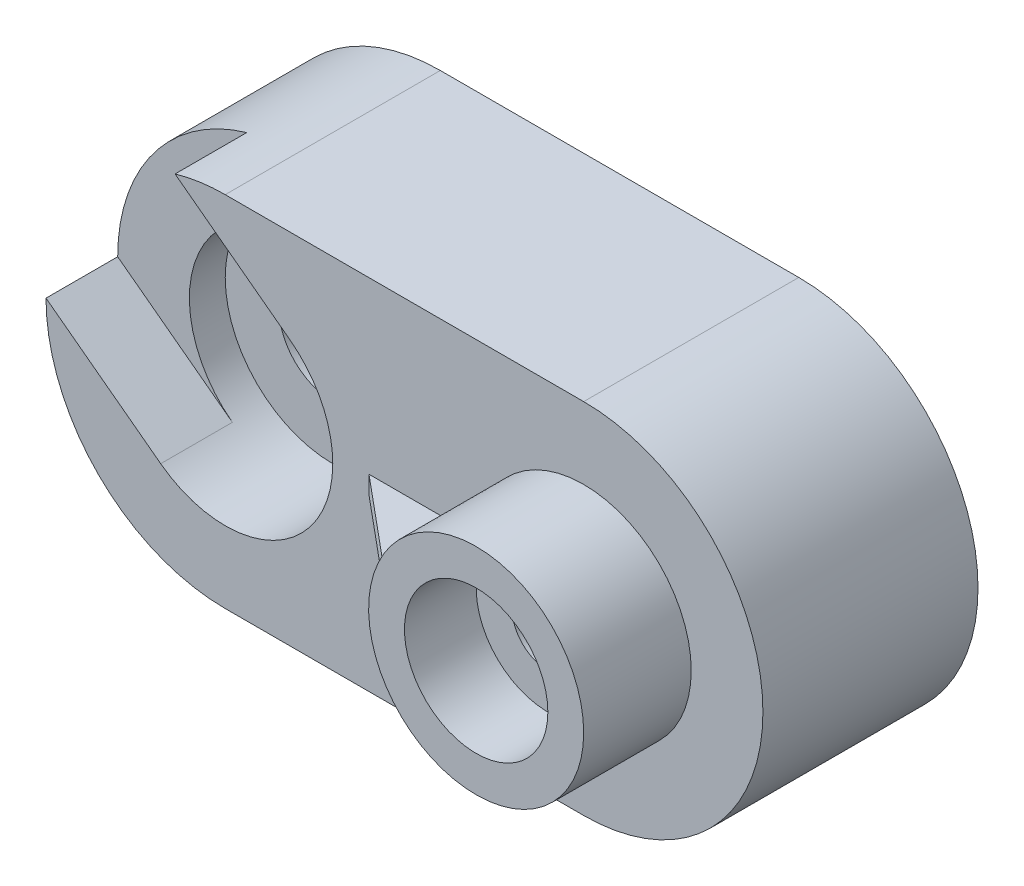
ISO-10303-21;
HEADER;
FILE_DESCRIPTION(('STEP AP214'),'2;1');
FILE_NAME('part.step','',(''),(''),'','','');
FILE_SCHEMA(('AUTOMOTIVE_DESIGN { 1 0 10303 214 1 1 1 1 }'));
ENDSEC;
DATA;
#1=APPLICATION_CONTEXT('core data for automotive mechanical design processes');
#2=APPLICATION_PROTOCOL_DEFINITION('international standard','automotive_design',2000,#1);
#3=PRODUCT_CONTEXT('',#1,'mechanical');
#4=PRODUCT('Part','Part','',(#3));
#5=PRODUCT_RELATED_PRODUCT_CATEGORY('part','',(#4));
#6=PRODUCT_DEFINITION_FORMATION('','',#4);
#7=PRODUCT_DEFINITION_CONTEXT('part definition',#1,'design');
#8=PRODUCT_DEFINITION('design','',#6,#7);
#9=PRODUCT_DEFINITION_SHAPE('','',#8);
#10=(LENGTH_UNIT() NAMED_UNIT(*) SI_UNIT(.MILLI.,.METRE.));
#11=(NAMED_UNIT(*) PLANE_ANGLE_UNIT() SI_UNIT($,.RADIAN.));
#12=(NAMED_UNIT(*) SI_UNIT($,.STERADIAN.) SOLID_ANGLE_UNIT());
#13=UNCERTAINTY_MEASURE_WITH_UNIT(LENGTH_MEASURE(1.E-05),#10,'distance_accuracy_value','');
#14=(GEOMETRIC_REPRESENTATION_CONTEXT(3) GLOBAL_UNCERTAINTY_ASSIGNED_CONTEXT((#13)) GLOBAL_UNIT_ASSIGNED_CONTEXT((#10,
#11,#12)) REPRESENTATION_CONTEXT('',''));
#15=CARTESIAN_POINT('',(0.,0.,0.));
#16=DIRECTION('',(0.,0.,1.));
#17=DIRECTION('',(1.,0.,0.));
#18=AXIS2_PLACEMENT_3D('',#15,#16,#17);
#19=CARTESIAN_POINT('',(0.,0.,60.));
#20=DIRECTION('',(0.,0.,1.));
#21=DIRECTION('',(1.,0.,0.));
#22=AXIS2_PLACEMENT_3D('',#19,#20,#21);
#23=PLANE('',#22);
#24=DIRECTION('',(0.,-1.,0.));
#25=VECTOR('',#24,1.);
#26=CARTESIAN_POINT('',(40.1043481422465,2.5,60.));
#27=LINE('',#26,#25);
#28=CARTESIAN_POINT('',(40.1043481422465,2.5,60.));
#29=VERTEX_POINT('',#28);
#30=CARTESIAN_POINT('',(40.1043481422465,-2.5,60.));
#31=VERTEX_POINT('',#30);
#32=EDGE_CURVE('E56',#29,#31,#27,.T.);
#33=ORIENTED_EDGE('',*,*,#32,.F.);
#34=DIRECTION('',(-1.,0.,0.));
#35=VECTOR('',#34,1.);
#36=CARTESIAN_POINT('',(70.1043481422465,2.5,60.));
#37=LINE('',#36,#35);
#38=CARTESIAN_POINT('',(70.1043481422465,2.5,60.));
#39=VERTEX_POINT('',#38);
#40=EDGE_CURVE('E278',#39,#29,#37,.T.);
#41=ORIENTED_EDGE('',*,*,#40,.F.);
#42=CARTESIAN_POINT('',(100.,0.,60.));
#43=DIRECTION('',(0.,0.,1.));
#44=DIRECTION('',(1.,0.,0.));
#45=AXIS2_PLACEMENT_3D('',#42,#43,#44);
#46=CIRCLE('',#45,30.);
#47=CARTESIAN_POINT('',(70.1043481422465,-2.5,60.));
#48=VERTEX_POINT('',#47);
#49=EDGE_CURVE('E178',#48,#39,#46,.T.);
#50=ORIENTED_EDGE('',*,*,#49,.F.);
#51=DIRECTION('',(1.,0.,0.));
#52=VECTOR('',#51,1.);
#53=CARTESIAN_POINT('',(70.1043481422465,-2.5,60.));
#54=LINE('',#53,#52);
#55=EDGE_CURVE('E162',#31,#48,#54,.T.);
#56=ORIENTED_EDGE('',*,*,#55,.F.);
#57=EDGE_LOOP('',(#33,#41,#50,#56));
#58=FACE_BOUND('',#57,.T.);
#59=CARTESIAN_POINT('',(0.,0.,60.));
#60=DIRECTION('',(0.,0.,1.));
#61=DIRECTION('',(1.,0.,0.));
#62=AXIS2_PLACEMENT_3D('',#59,#60,#61);
#63=CIRCLE('',#62,30.);
#64=CARTESIAN_POINT('',(-18.,-24.,60.));
#65=VERTEX_POINT('',#64);
#66=CARTESIAN_POINT('',(18.,24.,60.));
#67=VERTEX_POINT('',#66);
#68=EDGE_CURVE('E300',#65,#67,#63,.T.);
#69=ORIENTED_EDGE('',*,*,#68,.F.);
#70=DIRECTION('',(-0.8,0.6,0.));
#71=VECTOR('',#70,1.);
#72=CARTESIAN_POINT('',(-18.,-24.,60.));
#73=LINE('',#72,#71);
#74=CARTESIAN_POINT('',(-50.,0.,60.));
#75=VERTEX_POINT('',#74);
#76=EDGE_CURVE('E272',#65,#75,#73,.T.);
#77=ORIENTED_EDGE('',*,*,#76,.T.);
#78=CARTESIAN_POINT('',(0.,0.,60.));
#79=DIRECTION('',(0.,0.,1.));
#80=DIRECTION('',(1.,0.,0.));
#81=AXIS2_PLACEMENT_3D('',#78,#79,#80);
#82=CIRCLE('',#81,50.);
#83=CARTESIAN_POINT('',(0.,-50.,60.));
#84=VERTEX_POINT('',#83);
#85=EDGE_CURVE('E222',#75,#84,#82,.T.);
#86=ORIENTED_EDGE('',*,*,#85,.T.);
#87=DIRECTION('',(1.,0.,0.));
#88=VECTOR('',#87,1.);
#89=CARTESIAN_POINT('',(0.,-50.,60.));
#90=LINE('',#89,#88);
#91=CARTESIAN_POINT('',(100.,-50.,60.));
#92=VERTEX_POINT('',#91);
#93=EDGE_CURVE('E221',#84,#92,#90,.T.);
#94=ORIENTED_EDGE('',*,*,#93,.T.);
#95=CARTESIAN_POINT('',(100.,0.,60.));
#96=DIRECTION('',(0.,0.,1.));
#97=DIRECTION('',(1.,0.,0.));
#98=AXIS2_PLACEMENT_3D('',#95,#96,#97);
#99=CIRCLE('',#98,50.);
#100=CARTESIAN_POINT('',(100.,50.,60.));
#101=VERTEX_POINT('',#100);
#102=EDGE_CURVE('E224',#92,#101,#99,.T.);
#103=ORIENTED_EDGE('',*,*,#102,.T.);
#104=DIRECTION('',(-1.,0.,0.));
#105=VECTOR('',#104,1.);
#106=CARTESIAN_POINT('',(0.,50.,60.));
#107=LINE('',#106,#105);
#108=CARTESIAN_POINT('',(0.,50.,60.));
#109=VERTEX_POINT('',#108);
#110=EDGE_CURVE('E226',#101,#109,#107,.T.);
#111=ORIENTED_EDGE('',*,*,#110,.T.);
#112=CARTESIAN_POINT('',(-14.,48.,60.));
#113=VERTEX_POINT('',#112);
#114=EDGE_CURVE('E218',#109,#113,#82,.T.);
#115=ORIENTED_EDGE('',*,*,#114,.T.);
#116=DIRECTION('',(-0.8,0.6,0.));
#117=VECTOR('',#116,1.);
#118=CARTESIAN_POINT('',(18.,24.,60.));
#119=LINE('',#118,#117);
#120=EDGE_CURVE('E286',#67,#113,#119,.T.);
#121=ORIENTED_EDGE('',*,*,#120,.F.);
#122=EDGE_LOOP('',(#69,#77,#86,#94,#103,#111,#115,#121));
#123=FACE_BOUND('',#122,.T.);
#124=ADVANCED_FACE('F33',(#58,#123),#23,.T.);
#125=CARTESIAN_POINT('',(0.,0.,60.));
#126=DIRECTION('',(0.,0.,-1.));
#127=DIRECTION('',(-1.,0.,0.));
#128=AXIS2_PLACEMENT_3D('',#125,#126,#127);
#129=CYLINDRICAL_SURFACE('',#128,50.);
#130=DIRECTION('',(0.,0.,1.));
#131=VECTOR('',#130,1.);
#132=CARTESIAN_POINT('',(-50.,0.,40.));
#133=LINE('',#132,#131);
#134=CARTESIAN_POINT('',(-50.,0.,40.));
#135=VERTEX_POINT('',#134);
#136=EDGE_CURVE('E274',#135,#75,#133,.T.);
#137=ORIENTED_EDGE('',*,*,#136,.F.);
#138=CARTESIAN_POINT('',(0.,0.,40.));
#139=DIRECTION('',(0.,0.,1.));
#140=DIRECTION('',(1.,0.,0.));
#141=AXIS2_PLACEMENT_3D('',#138,#139,#140);
#142=CIRCLE('',#141,50.);
#143=CARTESIAN_POINT('',(-14.,48.,40.));
#144=VERTEX_POINT('',#143);
#145=EDGE_CURVE('E276',#144,#135,#142,.T.);
#146=ORIENTED_EDGE('',*,*,#145,.F.);
#147=DIRECTION('',(0.,0.,1.));
#148=VECTOR('',#147,1.);
#149=CARTESIAN_POINT('',(-14.,48.,40.));
#150=LINE('',#149,#148);
#151=EDGE_CURVE('E279',#144,#113,#150,.T.);
#152=ORIENTED_EDGE('',*,*,#151,.T.);
#153=ORIENTED_EDGE('',*,*,#114,.F.);
#154=DIRECTION('',(0.,0.,-1.));
#155=VECTOR('',#154,1.);
#156=CARTESIAN_POINT('',(0.,50.,60.));
#157=LINE('',#156,#155);
#158=CARTESIAN_POINT('',(0.,50.,0.));
#159=VERTEX_POINT('',#158);
#160=EDGE_CURVE('E228',#109,#159,#157,.T.);
#161=ORIENTED_EDGE('',*,*,#160,.T.);
#162=CARTESIAN_POINT('',(0.,0.,0.));
#163=DIRECTION('',(0.,0.,1.));
#164=DIRECTION('',(1.,0.,0.));
#165=AXIS2_PLACEMENT_3D('',#162,#163,#164);
#166=CIRCLE('',#165,50.);
#167=CARTESIAN_POINT('',(0.,-50.,0.));
#168=VERTEX_POINT('',#167);
#169=EDGE_CURVE('E211',#159,#168,#166,.T.);
#170=ORIENTED_EDGE('',*,*,#169,.T.);
#171=DIRECTION('',(0.,0.,-1.));
#172=VECTOR('',#171,1.);
#173=CARTESIAN_POINT('',(0.,-50.,60.));
#174=LINE('',#173,#172);
#175=EDGE_CURVE('E41',#84,#168,#174,.T.);
#176=ORIENTED_EDGE('',*,*,#175,.F.);
#177=ORIENTED_EDGE('',*,*,#85,.F.);
#178=EDGE_LOOP('',(#137,#146,#152,#153,#161,#170,#176,#177));
#179=FACE_BOUND('',#178,.T.);
#180=ADVANCED_FACE('F35',(#179),#129,.T.);
#181=CARTESIAN_POINT('',(100.,0.,90.));
#182=DIRECTION('',(0.,0.,-1.));
#183=DIRECTION('',(-1.,0.,0.));
#184=AXIS2_PLACEMENT_3D('',#181,#182,#183);
#185=CYLINDRICAL_SURFACE('',#184,30.);
#186=CARTESIAN_POINT('',(100.,0.,90.));
#187=DIRECTION('',(0.,0.,1.));
#188=DIRECTION('',(1.,0.,0.));
#189=AXIS2_PLACEMENT_3D('',#186,#187,#188);
#190=CIRCLE('',#189,30.);
#191=CARTESIAN_POINT('',(130.,0.,90.));
#192=VERTEX_POINT('',#191);
#193=EDGE_CURVE('E181',#192,#192,#190,.T.);
#194=ORIENTED_EDGE('',*,*,#193,.F.);
#195=EDGE_LOOP('',(#194));
#196=FACE_BOUND('',#195,.T.);
#197=DIRECTION('',(0.,0.,-1.));
#198=VECTOR('',#197,1.);
#199=CARTESIAN_POINT('',(70.1043481422465,2.5,85.));
#200=LINE('',#199,#198);
#201=CARTESIAN_POINT('',(70.1043481422465,2.5,85.));
#202=VERTEX_POINT('',#201);
#203=EDGE_CURVE('E160',#202,#39,#200,.T.);
#204=ORIENTED_EDGE('',*,*,#203,.F.);
#205=CARTESIAN_POINT('',(100.,0.,85.));
#206=DIRECTION('',(0.,0.,-1.));
#207=DIRECTION('',(-1.,0.,0.));
#208=AXIS2_PLACEMENT_3D('',#205,#206,#207);
#209=CIRCLE('',#208,30.);
#210=CARTESIAN_POINT('',(70.1043481422465,-2.5,85.));
#211=VERTEX_POINT('',#210);
#212=EDGE_CURVE('E11',#211,#202,#209,.T.);
#213=ORIENTED_EDGE('',*,*,#212,.F.);
#214=DIRECTION('',(0.,0.,-1.));
#215=VECTOR('',#214,1.);
#216=CARTESIAN_POINT('',(70.1043481422465,-2.5,85.));
#217=LINE('',#216,#215);
#218=EDGE_CURVE('E157',#211,#48,#217,.T.);
#219=ORIENTED_EDGE('',*,*,#218,.T.);
#220=ORIENTED_EDGE('',*,*,#49,.T.);
#221=EDGE_LOOP('',(#204,#213,#219,#220));
#222=FACE_BOUND('',#221,.T.);
#223=ADVANCED_FACE('F155',(#196,#222),#185,.T.);
#224=CARTESIAN_POINT('',(0.,-50.,60.));
#225=DIRECTION('',(0.,1.,0.));
#226=DIRECTION('',(0.,0.,1.));
#227=AXIS2_PLACEMENT_3D('',#224,#225,#226);
#228=PLANE('',#227);
#229=DIRECTION('',(1.,0.,0.));
#230=VECTOR('',#229,1.);
#231=CARTESIAN_POINT('',(0.,-50.,0.));
#232=LINE('',#231,#230);
#233=CARTESIAN_POINT('',(100.,-50.,0.));
#234=VERTEX_POINT('',#233);
#235=EDGE_CURVE('E231',#168,#234,#232,.T.);
#236=ORIENTED_EDGE('',*,*,#235,.T.);
#237=DIRECTION('',(0.,0.,-1.));
#238=VECTOR('',#237,1.);
#239=CARTESIAN_POINT('',(100.,-50.,60.));
#240=LINE('',#239,#238);
#241=EDGE_CURVE('E242',#92,#234,#240,.T.);
#242=ORIENTED_EDGE('',*,*,#241,.F.);
#243=ORIENTED_EDGE('',*,*,#93,.F.);
#244=ORIENTED_EDGE('',*,*,#175,.T.);
#245=EDGE_LOOP('',(#236,#242,#243,#244));
#246=FACE_BOUND('',#245,.T.);
#247=ADVANCED_FACE('F248',(#246),#228,.F.);
#248=CARTESIAN_POINT('',(100.,0.,60.));
#249=DIRECTION('',(0.,0.,-1.));
#250=DIRECTION('',(-1.,0.,0.));
#251=AXIS2_PLACEMENT_3D('',#248,#249,#250);
#252=CYLINDRICAL_SURFACE('',#251,50.);
#253=CARTESIAN_POINT('',(100.,0.,0.));
#254=DIRECTION('',(0.,0.,1.));
#255=DIRECTION('',(1.,0.,0.));
#256=AXIS2_PLACEMENT_3D('',#253,#254,#255);
#257=CIRCLE('',#256,50.);
#258=CARTESIAN_POINT('',(100.,50.,0.));
#259=VERTEX_POINT('',#258);
#260=EDGE_CURVE('E233',#234,#259,#257,.T.);
#261=ORIENTED_EDGE('',*,*,#260,.T.);
#262=DIRECTION('',(0.,0.,-1.));
#263=VECTOR('',#262,1.);
#264=CARTESIAN_POINT('',(100.,50.,60.));
#265=LINE('',#264,#263);
#266=EDGE_CURVE('E239',#101,#259,#265,.T.);
#267=ORIENTED_EDGE('',*,*,#266,.F.);
#268=ORIENTED_EDGE('',*,*,#102,.F.);
#269=ORIENTED_EDGE('',*,*,#241,.T.);
#270=EDGE_LOOP('',(#261,#267,#268,#269));
#271=FACE_BOUND('',#270,.T.);
#272=ADVANCED_FACE('F262',(#271),#252,.T.);
#273=CARTESIAN_POINT('',(0.,50.,60.));
#274=DIRECTION('',(0.,-1.,0.));
#275=DIRECTION('',(0.,0.,-1.));
#276=AXIS2_PLACEMENT_3D('',#273,#274,#275);
#277=PLANE('',#276);
#278=DIRECTION('',(-1.,0.,0.));
#279=VECTOR('',#278,1.);
#280=CARTESIAN_POINT('',(0.,50.,0.));
#281=LINE('',#280,#279);
#282=EDGE_CURVE('E235',#259,#159,#281,.T.);
#283=ORIENTED_EDGE('',*,*,#282,.T.);
#284=ORIENTED_EDGE('',*,*,#160,.F.);
#285=ORIENTED_EDGE('',*,*,#110,.F.);
#286=ORIENTED_EDGE('',*,*,#266,.T.);
#287=EDGE_LOOP('',(#283,#284,#285,#286));
#288=FACE_BOUND('',#287,.T.);
#289=ADVANCED_FACE('F266',(#288),#277,.F.);
#290=CARTESIAN_POINT('',(0.,0.,0.));
#291=DIRECTION('',(0.,0.,1.));
#292=DIRECTION('',(1.,0.,0.));
#293=AXIS2_PLACEMENT_3D('',#290,#291,#292);
#294=PLANE('',#293);
#295=DIRECTION('',(1.,0.,0.));
#296=VECTOR('',#295,1.);
#297=CARTESIAN_POINT('',(0.,30.,0.));
#298=LINE('',#297,#296);
#299=CARTESIAN_POINT('',(0.,30.,0.));
#300=VERTEX_POINT('',#299);
#301=CARTESIAN_POINT('',(100.,30.,0.));
#302=VERTEX_POINT('',#301);
#303=EDGE_CURVE('E201',#300,#302,#298,.T.);
#304=ORIENTED_EDGE('',*,*,#303,.F.);
#305=CARTESIAN_POINT('',(0.,0.,0.));
#306=DIRECTION('',(0.,0.,-1.));
#307=DIRECTION('',(-1.,0.,0.));
#308=AXIS2_PLACEMENT_3D('',#305,#306,#307);
#309=CIRCLE('',#308,30.);
#310=CARTESIAN_POINT('',(0.,-30.,0.));
#311=VERTEX_POINT('',#310);
#312=EDGE_CURVE('E184',#311,#300,#309,.T.);
#313=ORIENTED_EDGE('',*,*,#312,.F.);
#314=DIRECTION('',(-1.,0.,0.));
#315=VECTOR('',#314,1.);
#316=CARTESIAN_POINT('',(0.,-30.,0.));
#317=LINE('',#316,#315);
#318=CARTESIAN_POINT('',(100.,-30.,0.));
#319=VERTEX_POINT('',#318);
#320=EDGE_CURVE('E190',#319,#311,#317,.T.);
#321=ORIENTED_EDGE('',*,*,#320,.F.);
#322=CARTESIAN_POINT('',(100.,0.,0.));
#323=DIRECTION('',(0.,0.,-1.));
#324=DIRECTION('',(-1.,0.,0.));
#325=AXIS2_PLACEMENT_3D('',#322,#323,#324);
#326=CIRCLE('',#325,30.);
#327=EDGE_CURVE('E204',#302,#319,#326,.T.);
#328=ORIENTED_EDGE('',*,*,#327,.F.);
#329=EDGE_LOOP('',(#304,#313,#321,#328));
#330=FACE_BOUND('',#329,.T.);
#331=ORIENTED_EDGE('',*,*,#169,.F.);
#332=ORIENTED_EDGE('',*,*,#282,.F.);
#333=ORIENTED_EDGE('',*,*,#260,.F.);
#334=ORIENTED_EDGE('',*,*,#235,.F.);
#335=EDGE_LOOP('',(#331,#332,#333,#334));
#336=FACE_BOUND('',#335,.T.);
#337=ADVANCED_FACE('F258',(#330,#336),#294,.F.);
#338=CARTESIAN_POINT('',(0.,0.,10.));
#339=DIRECTION('',(0.,0.,-1.));
#340=DIRECTION('',(-1.,0.,0.));
#341=AXIS2_PLACEMENT_3D('',#338,#339,#340);
#342=CYLINDRICAL_SURFACE('',#341,30.);
#343=ORIENTED_EDGE('',*,*,#312,.T.);
#344=DIRECTION('',(0.,0.,-1.));
#345=VECTOR('',#344,1.);
#346=CARTESIAN_POINT('',(0.,30.,10.));
#347=LINE('',#346,#345);
#348=CARTESIAN_POINT('',(0.,30.,10.));
#349=VERTEX_POINT('',#348);
#350=EDGE_CURVE('E199',#349,#300,#347,.T.);
#351=ORIENTED_EDGE('',*,*,#350,.F.);
#352=CARTESIAN_POINT('',(0.,0.,10.));
#353=DIRECTION('',(0.,0.,-1.));
#354=DIRECTION('',(-1.,0.,0.));
#355=AXIS2_PLACEMENT_3D('',#352,#353,#354);
#356=CIRCLE('',#355,30.);
#357=CARTESIAN_POINT('',(0.,-30.,10.));
#358=VERTEX_POINT('',#357);
#359=EDGE_CURVE('E186',#358,#349,#356,.T.);
#360=ORIENTED_EDGE('',*,*,#359,.F.);
#361=DIRECTION('',(0.,0.,-1.));
#362=VECTOR('',#361,1.);
#363=CARTESIAN_POINT('',(0.,-30.,10.));
#364=LINE('',#363,#362);
#365=EDGE_CURVE('E209',#358,#311,#364,.T.);
#366=ORIENTED_EDGE('',*,*,#365,.T.);
#367=EDGE_LOOP('',(#343,#351,#360,#366));
#368=FACE_BOUND('',#367,.T.);
#369=ADVANCED_FACE('F327',(#368),#342,.F.);
#370=CARTESIAN_POINT('',(0.,-30.,10.));
#371=DIRECTION('',(0.,-1.,0.));
#372=DIRECTION('',(0.,0.,-1.));
#373=AXIS2_PLACEMENT_3D('',#370,#371,#372);
#374=PLANE('',#373);
#375=ORIENTED_EDGE('',*,*,#320,.T.);
#376=ORIENTED_EDGE('',*,*,#365,.F.);
#377=DIRECTION('',(-1.,0.,0.));
#378=VECTOR('',#377,1.);
#379=CARTESIAN_POINT('',(0.,-30.,10.));
#380=LINE('',#379,#378);
#381=CARTESIAN_POINT('',(100.,-30.,10.));
#382=VERTEX_POINT('',#381);
#383=EDGE_CURVE('E196',#382,#358,#380,.T.);
#384=ORIENTED_EDGE('',*,*,#383,.F.);
#385=DIRECTION('',(0.,0.,-1.));
#386=VECTOR('',#385,1.);
#387=CARTESIAN_POINT('',(100.,-30.,10.));
#388=LINE('',#387,#386);
#389=EDGE_CURVE('E212',#382,#319,#388,.T.);
#390=ORIENTED_EDGE('',*,*,#389,.T.);
#391=EDGE_LOOP('',(#375,#376,#384,#390));
#392=FACE_BOUND('',#391,.T.);
#393=ADVANCED_FACE('F353',(#392),#374,.F.);
#394=CARTESIAN_POINT('',(100.,0.,10.));
#395=DIRECTION('',(0.,0.,-1.));
#396=DIRECTION('',(-1.,0.,0.));
#397=AXIS2_PLACEMENT_3D('',#394,#395,#396);
#398=CYLINDRICAL_SURFACE('',#397,30.);
#399=ORIENTED_EDGE('',*,*,#327,.T.);
#400=ORIENTED_EDGE('',*,*,#389,.F.);
#401=CARTESIAN_POINT('',(100.,0.,10.));
#402=DIRECTION('',(0.,0.,-1.));
#403=DIRECTION('',(-1.,0.,0.));
#404=AXIS2_PLACEMENT_3D('',#401,#402,#403);
#405=CIRCLE('',#404,30.);
#406=CARTESIAN_POINT('',(100.,30.,10.));
#407=VERTEX_POINT('',#406);
#408=EDGE_CURVE('E193',#407,#382,#405,.T.);
#409=ORIENTED_EDGE('',*,*,#408,.F.);
#410=DIRECTION('',(0.,0.,-1.));
#411=VECTOR('',#410,1.);
#412=CARTESIAN_POINT('',(100.,30.,10.));
#413=LINE('',#412,#411);
#414=EDGE_CURVE('E214',#407,#302,#413,.T.);
#415=ORIENTED_EDGE('',*,*,#414,.T.);
#416=EDGE_LOOP('',(#399,#400,#409,#415));
#417=FACE_BOUND('',#416,.T.);
#418=ADVANCED_FACE('F356',(#417),#398,.F.);
#419=CARTESIAN_POINT('',(0.,30.,10.));
#420=DIRECTION('',(0.,1.,0.));
#421=DIRECTION('',(0.,0.,1.));
#422=AXIS2_PLACEMENT_3D('',#419,#420,#421);
#423=PLANE('',#422);
#424=ORIENTED_EDGE('',*,*,#303,.T.);
#425=ORIENTED_EDGE('',*,*,#414,.F.);
#426=DIRECTION('',(1.,0.,0.));
#427=VECTOR('',#426,1.);
#428=CARTESIAN_POINT('',(0.,30.,10.));
#429=LINE('',#428,#427);
#430=EDGE_CURVE('E189',#349,#407,#429,.T.);
#431=ORIENTED_EDGE('',*,*,#430,.F.);
#432=ORIENTED_EDGE('',*,*,#350,.T.);
#433=EDGE_LOOP('',(#424,#425,#431,#432));
#434=FACE_BOUND('',#433,.T.);
#435=ADVANCED_FACE('F351',(#434),#423,.F.);
#436=CARTESIAN_POINT('',(0.,0.,10.));
#437=DIRECTION('',(0.,0.,-1.));
#438=DIRECTION('',(-1.,0.,0.));
#439=AXIS2_PLACEMENT_3D('',#436,#437,#438);
#440=PLANE('',#439);
#441=CARTESIAN_POINT('',(0.,0.,10.));
#442=DIRECTION('',(0.,0.,-1.));
#443=DIRECTION('',(-1.,0.,0.));
#444=AXIS2_PLACEMENT_3D('',#441,#442,#443);
#445=CIRCLE('',#444,15.);
#446=CARTESIAN_POINT('',(-15.,0.,10.));
#447=VERTEX_POINT('',#446);
#448=EDGE_CURVE('E307',#447,#447,#445,.T.);
#449=ORIENTED_EDGE('',*,*,#448,.F.);
#450=EDGE_LOOP('',(#449));
#451=FACE_BOUND('',#450,.T.);
#452=CARTESIAN_POINT('',(100.,0.,9.99999999999999));
#453=DIRECTION('',(0.,0.,-1.));
#454=DIRECTION('',(-1.,0.,0.));
#455=AXIS2_PLACEMENT_3D('',#452,#453,#454);
#456=CIRCLE('',#455,9.99999999999999);
#457=CARTESIAN_POINT('',(90.,0.,9.99999999999999));
#458=VERTEX_POINT('',#457);
#459=EDGE_CURVE('E171',#458,#458,#456,.T.);
#460=ORIENTED_EDGE('',*,*,#459,.F.);
#461=EDGE_LOOP('',(#460));
#462=FACE_BOUND('',#461,.T.);
#463=ORIENTED_EDGE('',*,*,#359,.T.);
#464=ORIENTED_EDGE('',*,*,#430,.T.);
#465=ORIENTED_EDGE('',*,*,#408,.T.);
#466=ORIENTED_EDGE('',*,*,#383,.T.);
#467=EDGE_LOOP('',(#463,#464,#465,#466));
#468=FACE_BOUND('',#467,.T.);
#469=ADVANCED_FACE('F348',(#451,#462,#468),#440,.T.);
#470=CARTESIAN_POINT('',(100.,0.,90.));
#471=DIRECTION('',(0.,0.,1.));
#472=DIRECTION('',(1.,0.,0.));
#473=AXIS2_PLACEMENT_3D('',#470,#471,#472);
#474=PLANE('',#473);
#475=CARTESIAN_POINT('',(100.,0.,90.));
#476=DIRECTION('',(0.,0.,1.));
#477=DIRECTION('',(1.,0.,0.));
#478=AXIS2_PLACEMENT_3D('',#475,#476,#477);
#479=CIRCLE('',#478,20.);
#480=CARTESIAN_POINT('',(120.,0.,90.));
#481=VERTEX_POINT('',#480);
#482=EDGE_CURVE('E174',#481,#481,#479,.T.);
#483=ORIENTED_EDGE('',*,*,#482,.F.);
#484=EDGE_LOOP('',(#483));
#485=FACE_BOUND('',#484,.T.);
#486=ORIENTED_EDGE('',*,*,#193,.T.);
#487=EDGE_LOOP('',(#486));
#488=FACE_BOUND('',#487,.T.);
#489=ADVANCED_FACE('F346',(#485,#488),#474,.T.);
#490=CARTESIAN_POINT('',(100.,0.,70.));
#491=DIRECTION('',(0.,0.,1.));
#492=DIRECTION('',(1.,0.,0.));
#493=AXIS2_PLACEMENT_3D('',#490,#491,#492);
#494=CYLINDRICAL_SURFACE('',#493,20.);
#495=CARTESIAN_POINT('',(100.,0.,70.));
#496=DIRECTION('',(0.,0.,1.));
#497=DIRECTION('',(1.,0.,0.));
#498=AXIS2_PLACEMENT_3D('',#495,#496,#497);
#499=CIRCLE('',#498,20.);
#500=CARTESIAN_POINT('',(120.,0.,70.));
#501=VERTEX_POINT('',#500);
#502=EDGE_CURVE('E175',#501,#501,#499,.T.);
#503=ORIENTED_EDGE('',*,*,#502,.F.);
#504=EDGE_LOOP('',(#503));
#505=FACE_BOUND('',#504,.T.);
#506=ORIENTED_EDGE('',*,*,#482,.T.);
#507=EDGE_LOOP('',(#506));
#508=FACE_BOUND('',#507,.T.);
#509=ADVANCED_FACE('F402',(#505,#508),#494,.F.);
#510=CARTESIAN_POINT('',(100.,0.,70.));
#511=DIRECTION('',(0.,0.,1.));
#512=DIRECTION('',(1.,0.,0.));
#513=AXIS2_PLACEMENT_3D('',#510,#511,#512);
#514=PLANE('',#513);
#515=CARTESIAN_POINT('',(100.,0.,70.));
#516=DIRECTION('',(0.,0.,1.));
#517=DIRECTION('',(1.,0.,0.));
#518=AXIS2_PLACEMENT_3D('',#515,#516,#517);
#519=CIRCLE('',#518,9.99999999999999);
#520=CARTESIAN_POINT('',(110.,0.,70.));
#521=VERTEX_POINT('',#520);
#522=EDGE_CURVE('E164',#521,#521,#519,.T.);
#523=ORIENTED_EDGE('',*,*,#522,.F.);
#524=EDGE_LOOP('',(#523));
#525=FACE_BOUND('',#524,.T.);
#526=ORIENTED_EDGE('',*,*,#502,.T.);
#527=EDGE_LOOP('',(#526));
#528=FACE_BOUND('',#527,.T.);
#529=ADVANCED_FACE('F411',(#525,#528),#514,.T.);
#530=CARTESIAN_POINT('',(100.,0.,-59.));
#531=DIRECTION('',(0.,0.,1.));
#532=DIRECTION('',(1.,0.,0.));
#533=AXIS2_PLACEMENT_3D('',#530,#531,#532);
#534=CYLINDRICAL_SURFACE('',#533,9.99999999999999);
#535=ORIENTED_EDGE('',*,*,#459,.T.);
#536=EDGE_LOOP('',(#535));
#537=FACE_BOUND('',#536,.T.);
#538=ORIENTED_EDGE('',*,*,#522,.T.);
#539=EDGE_LOOP('',(#538));
#540=FACE_BOUND('',#539,.T.);
#541=ADVANCED_FACE('F420',(#537,#540),#534,.F.);
#542=CARTESIAN_POINT('',(70.1043481422465,2.5,85.));
#543=DIRECTION('',(0.,-1.,0.));
#544=DIRECTION('',(1.,0.,0.));
#545=AXIS2_PLACEMENT_3D('',#542,#543,#544);
#546=PLANE('',#545);
#547=ORIENTED_EDGE('',*,*,#40,.T.);
#548=DIRECTION('',(0.768221279597376,0.,0.64018439966448));
#549=VECTOR('',#548,1.);
#550=CARTESIAN_POINT('',(70.1043481422465,2.5,85.));
#551=LINE('',#550,#549);
#552=EDGE_CURVE('E144',#29,#202,#551,.T.);
#553=ORIENTED_EDGE('',*,*,#552,.T.);
#554=ORIENTED_EDGE('',*,*,#203,.T.);
#555=EDGE_LOOP('',(#547,#553,#554));
#556=FACE_BOUND('',#555,.T.);
#557=ADVANCED_FACE('F316',(#556),#546,.F.);
#558=CARTESIAN_POINT('',(70.1043481422465,-2.5,85.));
#559=DIRECTION('',(0.,1.,0.));
#560=DIRECTION('',(-1.,0.,0.));
#561=AXIS2_PLACEMENT_3D('',#558,#559,#560);
#562=PLANE('',#561);
#563=ORIENTED_EDGE('',*,*,#218,.F.);
#564=DIRECTION('',(0.768221279597376,0.,0.64018439966448));
#565=VECTOR('',#564,1.);
#566=CARTESIAN_POINT('',(40.1043481422465,-2.5,60.));
#567=LINE('',#566,#565);
#568=EDGE_CURVE('E145',#31,#211,#567,.T.);
#569=ORIENTED_EDGE('',*,*,#568,.F.);
#570=ORIENTED_EDGE('',*,*,#55,.T.);
#571=EDGE_LOOP('',(#563,#569,#570));
#572=FACE_BOUND('',#571,.T.);
#573=ADVANCED_FACE('F161',(#572),#562,.F.);
#574=CARTESIAN_POINT('',(-18.,-24.,40.));
#575=DIRECTION('',(0.6,0.8,0.));
#576=DIRECTION('',(-0.8,0.6,0.));
#577=AXIS2_PLACEMENT_3D('',#574,#575,#576);
#578=PLANE('',#577);
#579=ORIENTED_EDGE('',*,*,#76,.F.);
#580=DIRECTION('',(0.,0.,1.));
#581=VECTOR('',#580,1.);
#582=CARTESIAN_POINT('',(-18.,-24.,40.));
#583=LINE('',#582,#581);
#584=CARTESIAN_POINT('',(-18.,-24.,40.));
#585=VERTEX_POINT('',#584);
#586=EDGE_CURVE('E290',#585,#65,#583,.T.);
#587=ORIENTED_EDGE('',*,*,#586,.F.);
#588=DIRECTION('',(-0.8,0.6,0.));
#589=VECTOR('',#588,1.);
#590=CARTESIAN_POINT('',(-18.,-24.,40.));
#591=LINE('',#590,#589);
#592=EDGE_CURVE('E296',#585,#135,#591,.T.);
#593=ORIENTED_EDGE('',*,*,#592,.T.);
#594=ORIENTED_EDGE('',*,*,#136,.T.);
#595=EDGE_LOOP('',(#579,#587,#593,#594));
#596=FACE_BOUND('',#595,.T.);
#597=ADVANCED_FACE('F443',(#596),#578,.T.);
#598=CARTESIAN_POINT('',(18.,24.,40.));
#599=DIRECTION('',(0.6,0.8,0.));
#600=DIRECTION('',(-0.8,0.6,0.));
#601=AXIS2_PLACEMENT_3D('',#598,#599,#600);
#602=PLANE('',#601);
#603=ORIENTED_EDGE('',*,*,#120,.T.);
#604=ORIENTED_EDGE('',*,*,#151,.F.);
#605=DIRECTION('',(-0.8,0.6,0.));
#606=VECTOR('',#605,1.);
#607=CARTESIAN_POINT('',(18.,24.,40.));
#608=LINE('',#607,#606);
#609=CARTESIAN_POINT('',(18.,24.,40.));
#610=VERTEX_POINT('',#609);
#611=EDGE_CURVE('E48',#610,#144,#608,.T.);
#612=ORIENTED_EDGE('',*,*,#611,.F.);
#613=DIRECTION('',(0.,0.,1.));
#614=VECTOR('',#613,1.);
#615=CARTESIAN_POINT('',(18.,24.,40.));
#616=LINE('',#615,#614);
#617=EDGE_CURVE('E283',#610,#67,#616,.T.);
#618=ORIENTED_EDGE('',*,*,#617,.T.);
#619=EDGE_LOOP('',(#603,#604,#612,#618));
#620=FACE_BOUND('',#619,.T.);
#621=ADVANCED_FACE('F448',(#620),#602,.F.);
#622=CARTESIAN_POINT('',(0.,0.,40.));
#623=DIRECTION('',(0.,0.,1.));
#624=DIRECTION('',(1.,0.,0.));
#625=AXIS2_PLACEMENT_3D('',#622,#623,#624);
#626=CYLINDRICAL_SURFACE('',#625,30.);
#627=ORIENTED_EDGE('',*,*,#68,.T.);
#628=ORIENTED_EDGE('',*,*,#617,.F.);
#629=CARTESIAN_POINT('',(0.,0.,40.));
#630=DIRECTION('',(0.,0.,1.));
#631=DIRECTION('',(1.,0.,0.));
#632=AXIS2_PLACEMENT_3D('',#629,#630,#631);
#633=CIRCLE('',#632,30.);
#634=EDGE_CURVE('E305',#610,#585,#633,.T.);
#635=ORIENTED_EDGE('',*,*,#634,.T.);
#636=ORIENTED_EDGE('',*,*,#586,.T.);
#637=EDGE_LOOP('',(#627,#628,#635,#636));
#638=FACE_BOUND('',#637,.T.);
#639=CARTESIAN_POINT('',(0.,0.,30.));
#640=DIRECTION('',(0.,0.,1.));
#641=DIRECTION('',(1.,0.,0.));
#642=AXIS2_PLACEMENT_3D('',#639,#640,#641);
#643=CIRCLE('',#642,30.);
#644=CARTESIAN_POINT('',(30.,0.,30.));
#645=VERTEX_POINT('',#644);
#646=EDGE_CURVE('E301',#645,#645,#643,.T.);
#647=ORIENTED_EDGE('',*,*,#646,.F.);
#648=EDGE_LOOP('',(#647));
#649=FACE_BOUND('',#648,.T.);
#650=ADVANCED_FACE('F458',(#638,#649),#626,.F.);
#651=CARTESIAN_POINT('',(0.,0.,40.));
#652=DIRECTION('',(0.,0.,1.));
#653=DIRECTION('',(1.,0.,0.));
#654=AXIS2_PLACEMENT_3D('',#651,#652,#653);
#655=PLANE('',#654);
#656=ORIENTED_EDGE('',*,*,#634,.F.);
#657=ORIENTED_EDGE('',*,*,#611,.T.);
#658=ORIENTED_EDGE('',*,*,#145,.T.);
#659=ORIENTED_EDGE('',*,*,#592,.F.);
#660=EDGE_LOOP('',(#656,#657,#658,#659));
#661=FACE_BOUND('',#660,.T.);
#662=ADVANCED_FACE('F468',(#661),#655,.T.);
#663=CARTESIAN_POINT('',(0.,0.,30.));
#664=DIRECTION('',(0.,0.,1.));
#665=DIRECTION('',(1.,0.,0.));
#666=AXIS2_PLACEMENT_3D('',#663,#664,#665);
#667=PLANE('',#666);
#668=CARTESIAN_POINT('',(0.,0.,30.));
#669=DIRECTION('',(0.,0.,1.));
#670=DIRECTION('',(1.,0.,0.));
#671=AXIS2_PLACEMENT_3D('',#668,#669,#670);
#672=CIRCLE('',#671,15.);
#673=CARTESIAN_POINT('',(15.,0.,30.));
#674=VERTEX_POINT('',#673);
#675=EDGE_CURVE('E312',#674,#674,#672,.T.);
#676=ORIENTED_EDGE('',*,*,#675,.F.);
#677=EDGE_LOOP('',(#676));
#678=FACE_BOUND('',#677,.T.);
#679=ORIENTED_EDGE('',*,*,#646,.T.);
#680=EDGE_LOOP('',(#679));
#681=FACE_BOUND('',#680,.T.);
#682=ADVANCED_FACE('F477',(#678,#681),#667,.T.);
#683=CARTESIAN_POINT('',(0.,0.,-125.));
#684=DIRECTION('',(0.,0.,1.));
#685=DIRECTION('',(1.,0.,0.));
#686=AXIS2_PLACEMENT_3D('',#683,#684,#685);
#687=CYLINDRICAL_SURFACE('',#686,15.);
#688=ORIENTED_EDGE('',*,*,#448,.T.);
#689=EDGE_LOOP('',(#688));
#690=FACE_BOUND('',#689,.T.);
#691=ORIENTED_EDGE('',*,*,#675,.T.);
#692=EDGE_LOOP('',(#691));
#693=FACE_BOUND('',#692,.T.);
#694=ADVANCED_FACE('F488',(#690,#693),#687,.F.);
#695=CARTESIAN_POINT('',(70.1043481422465,7.5,85.));
#696=DIRECTION('',(0.,0.,1.));
#697=DIRECTION('',(1.,0.,0.));
#698=AXIS2_PLACEMENT_3D('',#695,#696,#697);
#699=PLANE('',#698);
#700=DIRECTION('',(0.,-1.,0.));
#701=VECTOR('',#700,1.);
#702=CARTESIAN_POINT('',(70.1043481422465,7.5,85.));
#703=LINE('',#702,#701);
#704=EDGE_CURVE('E140',#202,#211,#703,.T.);
#705=ORIENTED_EDGE('',*,*,#704,.T.);
#706=ORIENTED_EDGE('',*,*,#212,.T.);
#707=EDGE_LOOP('',(#705,#706));
#708=FACE_BOUND('',#707,.T.);
#709=ADVANCED_FACE('F141',(#708),#699,.F.);
#710=CARTESIAN_POINT('',(40.1043481422465,7.5,60.));
#711=DIRECTION('',(0.64018439966448,0.,-0.768221279597376));
#712=DIRECTION('',(-0.768221279597376,0.,-0.64018439966448));
#713=AXIS2_PLACEMENT_3D('',#710,#711,#712);
#714=PLANE('',#713);
#715=ORIENTED_EDGE('',*,*,#32,.T.);
#716=ORIENTED_EDGE('',*,*,#568,.T.);
#717=ORIENTED_EDGE('',*,*,#704,.F.);
#718=ORIENTED_EDGE('',*,*,#552,.F.);
#719=EDGE_LOOP('',(#715,#716,#717,#718));
#720=FACE_BOUND('',#719,.T.);
#721=ADVANCED_FACE('F147',(#720),#714,.F.);
#722=CLOSED_SHELL('',(#124,#180,#223,#247,#272,#289,#337,#369,#393,#418,#435,#469,#489,#509,
#529,#541,#557,#573,#597,#621,#650,#662,#682,#694,#709,#721));
#723=MANIFOLD_SOLID_BREP('B2',#722);
#724=ADVANCED_BREP_SHAPE_REPRESENTATION('',(#18,#723),#14);
#725=SHAPE_DEFINITION_REPRESENTATION(#9,#724);
ENDSEC;
END-ISO-10303-21;
